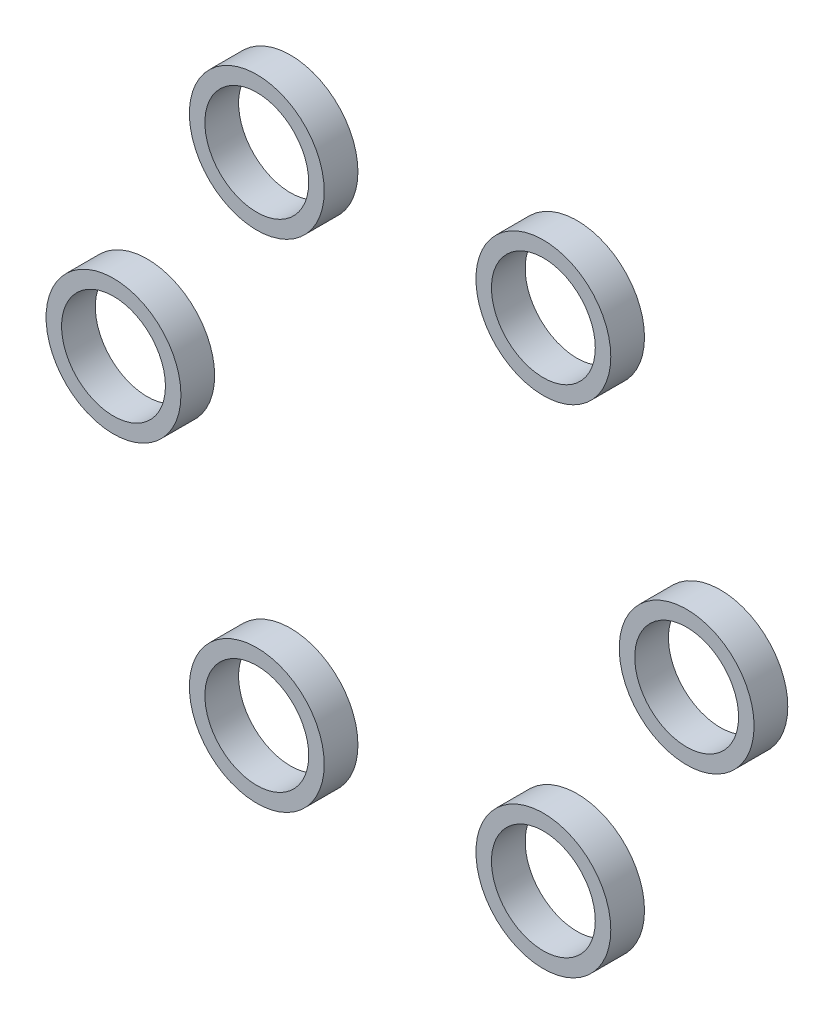
ISO-10303-21;
HEADER;
FILE_DESCRIPTION(('STEP AP214'),'2;1');
FILE_NAME('part.step','',(''),(''),'','','');
FILE_SCHEMA(('AUTOMOTIVE_DESIGN { 1 0 10303 214 1 1 1 1 }'));
ENDSEC;
DATA;
#1=APPLICATION_CONTEXT('core data for automotive mechanical design processes');
#2=APPLICATION_PROTOCOL_DEFINITION('international standard','automotive_design',2000,#1);
#3=PRODUCT_CONTEXT('',#1,'mechanical');
#4=PRODUCT('Part','Part','',(#3));
#5=PRODUCT_RELATED_PRODUCT_CATEGORY('part','',(#4));
#6=PRODUCT_DEFINITION_FORMATION('','',#4);
#7=PRODUCT_DEFINITION_CONTEXT('part definition',#1,'design');
#8=PRODUCT_DEFINITION('design','',#6,#7);
#9=PRODUCT_DEFINITION_SHAPE('','',#8);
#10=(LENGTH_UNIT() NAMED_UNIT(*) SI_UNIT(.MILLI.,.METRE.));
#11=(NAMED_UNIT(*) PLANE_ANGLE_UNIT() SI_UNIT($,.RADIAN.));
#12=(NAMED_UNIT(*) SI_UNIT($,.STERADIAN.) SOLID_ANGLE_UNIT());
#13=UNCERTAINTY_MEASURE_WITH_UNIT(LENGTH_MEASURE(1.E-05),#10,'distance_accuracy_value','');
#14=(GEOMETRIC_REPRESENTATION_CONTEXT(3) GLOBAL_UNCERTAINTY_ASSIGNED_CONTEXT((#13)) GLOBAL_UNIT_ASSIGNED_CONTEXT((#10,
#11,#12)) REPRESENTATION_CONTEXT('',''));
#15=CARTESIAN_POINT('',(0.,0.,0.));
#16=DIRECTION('',(0.,0.,1.));
#17=DIRECTION('',(1.,0.,0.));
#18=AXIS2_PLACEMENT_3D('',#15,#16,#17);
#19=CARTESIAN_POINT('',(-8.5,14.7224318643355,-15.5));
#20=DIRECTION('',(0.,0.,-1.));
#21=DIRECTION('',(-1.,0.,0.));
#22=AXIS2_PLACEMENT_3D('',#19,#20,#21);
#23=CYLINDRICAL_SURFACE('',#22,3.08);
#24=CARTESIAN_POINT('',(-8.5,14.7224318643355,-15.5));
#25=DIRECTION('',(0.,0.,1.));
#26=DIRECTION('',(1.,0.,0.));
#27=AXIS2_PLACEMENT_3D('',#24,#25,#26);
#28=CIRCLE('',#27,3.08);
#29=CARTESIAN_POINT('',(-5.42,14.7224318643355,-15.5));
#30=VERTEX_POINT('',#29);
#31=EDGE_CURVE('P0_E10',#30,#30,#28,.T.);
#32=ORIENTED_EDGE('',*,*,#31,.T.);
#33=EDGE_LOOP('',(#32));
#34=FACE_BOUND('',#33,.T.);
#35=CARTESIAN_POINT('',(-8.5,14.7224318643355,-17.5));
#36=DIRECTION('',(0.,0.,1.));
#37=DIRECTION('',(1.,0.,0.));
#38=AXIS2_PLACEMENT_3D('',#35,#36,#37);
#39=CIRCLE('',#38,3.08);
#40=CARTESIAN_POINT('',(-5.42,14.7224318643355,-17.5));
#41=VERTEX_POINT('',#40);
#42=EDGE_CURVE('P0_E20',#41,#41,#39,.T.);
#43=ORIENTED_EDGE('',*,*,#42,.F.);
#44=EDGE_LOOP('',(#43));
#45=FACE_BOUND('',#44,.T.);
#46=ADVANCED_FACE('P0_F14',(#34,#45),#23,.F.);
#47=CARTESIAN_POINT('',(-8.5,14.7224318643355,-15.5));
#48=DIRECTION('',(0.,0.,-1.));
#49=DIRECTION('',(-1.,0.,0.));
#50=AXIS2_PLACEMENT_3D('',#47,#48,#49);
#51=CYLINDRICAL_SURFACE('',#50,4.);
#52=CARTESIAN_POINT('',(-8.5,14.7224318643355,-15.5));
#53=DIRECTION('',(0.,0.,1.));
#54=DIRECTION('',(1.,0.,0.));
#55=AXIS2_PLACEMENT_3D('',#52,#53,#54);
#56=CIRCLE('',#55,4.);
#57=CARTESIAN_POINT('',(-4.5,14.7224318643355,-15.5));
#58=VERTEX_POINT('',#57);
#59=EDGE_CURVE('P0_E24',#58,#58,#56,.T.);
#60=ORIENTED_EDGE('',*,*,#59,.F.);
#61=EDGE_LOOP('',(#60));
#62=FACE_BOUND('',#61,.T.);
#63=CARTESIAN_POINT('',(-8.5,14.7224318643355,-17.5));
#64=DIRECTION('',(0.,0.,1.));
#65=DIRECTION('',(1.,0.,0.));
#66=AXIS2_PLACEMENT_3D('',#63,#64,#65);
#67=CIRCLE('',#66,4.);
#68=CARTESIAN_POINT('',(-4.5,14.7224318643355,-17.5));
#69=VERTEX_POINT('',#68);
#70=EDGE_CURVE('P0_E28',#69,#69,#67,.T.);
#71=ORIENTED_EDGE('',*,*,#70,.T.);
#72=EDGE_LOOP('',(#71));
#73=FACE_BOUND('',#72,.T.);
#74=ADVANCED_FACE('P0_F34',(#62,#73),#51,.T.);
#75=CARTESIAN_POINT('',(0.,0.,-15.5));
#76=DIRECTION('',(0.,0.,1.));
#77=DIRECTION('',(1.,0.,0.));
#78=AXIS2_PLACEMENT_3D('',#75,#76,#77);
#79=PLANE('',#78);
#80=ORIENTED_EDGE('',*,*,#31,.F.);
#81=EDGE_LOOP('',(#80));
#82=FACE_BOUND('',#81,.T.);
#83=ORIENTED_EDGE('',*,*,#59,.T.);
#84=EDGE_LOOP('',(#83));
#85=FACE_BOUND('',#84,.T.);
#86=ADVANCED_FACE('P0_F38',(#82,#85),#79,.T.);
#87=CARTESIAN_POINT('',(0.,0.,-17.5));
#88=DIRECTION('',(0.,0.,1.));
#89=DIRECTION('',(1.,0.,0.));
#90=AXIS2_PLACEMENT_3D('',#87,#88,#89);
#91=PLANE('',#90);
#92=ORIENTED_EDGE('',*,*,#42,.T.);
#93=EDGE_LOOP('',(#92));
#94=FACE_BOUND('',#93,.T.);
#95=ORIENTED_EDGE('',*,*,#70,.F.);
#96=EDGE_LOOP('',(#95));
#97=FACE_BOUND('',#96,.T.);
#98=ADVANCED_FACE('P0_F36',(#94,#97),#91,.F.);
#99=CLOSED_SHELL('',(#46,#74,#86,#98));
#100=MANIFOLD_SOLID_BREP('P0_B1',#99);
#101=CARTESIAN_POINT('',(-17.,0.,-15.5));
#102=DIRECTION('',(0.,0.,-1.));
#103=DIRECTION('',(-1.,0.,0.));
#104=AXIS2_PLACEMENT_3D('',#101,#102,#103);
#105=CYLINDRICAL_SURFACE('',#104,3.08);
#106=CARTESIAN_POINT('',(-17.,0.,-15.5));
#107=DIRECTION('',(0.,0.,1.));
#108=DIRECTION('',(1.,0.,0.));
#109=AXIS2_PLACEMENT_3D('',#106,#107,#108);
#110=CIRCLE('',#109,3.08);
#111=CARTESIAN_POINT('',(-13.92,0.,-15.5));
#112=VERTEX_POINT('',#111);
#113=EDGE_CURVE('P1_E10',#112,#112,#110,.T.);
#114=ORIENTED_EDGE('',*,*,#113,.T.);
#115=EDGE_LOOP('',(#114));
#116=FACE_BOUND('',#115,.T.);
#117=CARTESIAN_POINT('',(-17.,0.,-17.5));
#118=DIRECTION('',(0.,0.,1.));
#119=DIRECTION('',(1.,0.,0.));
#120=AXIS2_PLACEMENT_3D('',#117,#118,#119);
#121=CIRCLE('',#120,3.08);
#122=CARTESIAN_POINT('',(-13.92,0.,-17.5));
#123=VERTEX_POINT('',#122);
#124=EDGE_CURVE('P1_E20',#123,#123,#121,.T.);
#125=ORIENTED_EDGE('',*,*,#124,.F.);
#126=EDGE_LOOP('',(#125));
#127=FACE_BOUND('',#126,.T.);
#128=ADVANCED_FACE('P1_F14',(#116,#127),#105,.F.);
#129=CARTESIAN_POINT('',(-17.,0.,-15.5));
#130=DIRECTION('',(0.,0.,-1.));
#131=DIRECTION('',(-1.,0.,0.));
#132=AXIS2_PLACEMENT_3D('',#129,#130,#131);
#133=CYLINDRICAL_SURFACE('',#132,4.);
#134=CARTESIAN_POINT('',(-17.,0.,-15.5));
#135=DIRECTION('',(0.,0.,1.));
#136=DIRECTION('',(1.,0.,0.));
#137=AXIS2_PLACEMENT_3D('',#134,#135,#136);
#138=CIRCLE('',#137,4.);
#139=CARTESIAN_POINT('',(-13.,0.,-15.5));
#140=VERTEX_POINT('',#139);
#141=EDGE_CURVE('P1_E24',#140,#140,#138,.T.);
#142=ORIENTED_EDGE('',*,*,#141,.F.);
#143=EDGE_LOOP('',(#142));
#144=FACE_BOUND('',#143,.T.);
#145=CARTESIAN_POINT('',(-17.,0.,-17.5));
#146=DIRECTION('',(0.,0.,1.));
#147=DIRECTION('',(1.,0.,0.));
#148=AXIS2_PLACEMENT_3D('',#145,#146,#147);
#149=CIRCLE('',#148,4.);
#150=CARTESIAN_POINT('',(-13.,0.,-17.5));
#151=VERTEX_POINT('',#150);
#152=EDGE_CURVE('P1_E28',#151,#151,#149,.T.);
#153=ORIENTED_EDGE('',*,*,#152,.T.);
#154=EDGE_LOOP('',(#153));
#155=FACE_BOUND('',#154,.T.);
#156=ADVANCED_FACE('P1_F34',(#144,#155),#133,.T.);
#157=CARTESIAN_POINT('',(0.,0.,-15.5));
#158=DIRECTION('',(0.,0.,1.));
#159=DIRECTION('',(1.,0.,0.));
#160=AXIS2_PLACEMENT_3D('',#157,#158,#159);
#161=PLANE('',#160);
#162=ORIENTED_EDGE('',*,*,#113,.F.);
#163=EDGE_LOOP('',(#162));
#164=FACE_BOUND('',#163,.T.);
#165=ORIENTED_EDGE('',*,*,#141,.T.);
#166=EDGE_LOOP('',(#165));
#167=FACE_BOUND('',#166,.T.);
#168=ADVANCED_FACE('P1_F38',(#164,#167),#161,.T.);
#169=CARTESIAN_POINT('',(0.,0.,-17.5));
#170=DIRECTION('',(0.,0.,1.));
#171=DIRECTION('',(1.,0.,0.));
#172=AXIS2_PLACEMENT_3D('',#169,#170,#171);
#173=PLANE('',#172);
#174=ORIENTED_EDGE('',*,*,#124,.T.);
#175=EDGE_LOOP('',(#174));
#176=FACE_BOUND('',#175,.T.);
#177=ORIENTED_EDGE('',*,*,#152,.F.);
#178=EDGE_LOOP('',(#177));
#179=FACE_BOUND('',#178,.T.);
#180=ADVANCED_FACE('P1_F36',(#176,#179),#173,.F.);
#181=CLOSED_SHELL('',(#128,#156,#168,#180));
#182=MANIFOLD_SOLID_BREP('P1_B1',#181);
#183=CARTESIAN_POINT('',(17.,0.,-15.5));
#184=DIRECTION('',(0.,0.,-1.));
#185=DIRECTION('',(-1.,0.,0.));
#186=AXIS2_PLACEMENT_3D('',#183,#184,#185);
#187=CYLINDRICAL_SURFACE('',#186,3.08);
#188=CARTESIAN_POINT('',(17.,0.,-15.5));
#189=DIRECTION('',(0.,0.,1.));
#190=DIRECTION('',(1.,0.,0.));
#191=AXIS2_PLACEMENT_3D('',#188,#189,#190);
#192=CIRCLE('',#191,3.08);
#193=CARTESIAN_POINT('',(20.08,0.,-15.5));
#194=VERTEX_POINT('',#193);
#195=EDGE_CURVE('P2_E10',#194,#194,#192,.T.);
#196=ORIENTED_EDGE('',*,*,#195,.T.);
#197=EDGE_LOOP('',(#196));
#198=FACE_BOUND('',#197,.T.);
#199=CARTESIAN_POINT('',(17.,0.,-17.5));
#200=DIRECTION('',(0.,0.,1.));
#201=DIRECTION('',(1.,0.,0.));
#202=AXIS2_PLACEMENT_3D('',#199,#200,#201);
#203=CIRCLE('',#202,3.08);
#204=CARTESIAN_POINT('',(20.08,0.,-17.5));
#205=VERTEX_POINT('',#204);
#206=EDGE_CURVE('P2_E20',#205,#205,#203,.T.);
#207=ORIENTED_EDGE('',*,*,#206,.F.);
#208=EDGE_LOOP('',(#207));
#209=FACE_BOUND('',#208,.T.);
#210=ADVANCED_FACE('P2_F14',(#198,#209),#187,.F.);
#211=CARTESIAN_POINT('',(17.,0.,-15.5));
#212=DIRECTION('',(0.,0.,-1.));
#213=DIRECTION('',(-1.,0.,0.));
#214=AXIS2_PLACEMENT_3D('',#211,#212,#213);
#215=CYLINDRICAL_SURFACE('',#214,4.);
#216=CARTESIAN_POINT('',(17.,0.,-15.5));
#217=DIRECTION('',(0.,0.,1.));
#218=DIRECTION('',(1.,0.,0.));
#219=AXIS2_PLACEMENT_3D('',#216,#217,#218);
#220=CIRCLE('',#219,4.);
#221=CARTESIAN_POINT('',(21.,0.,-15.5));
#222=VERTEX_POINT('',#221);
#223=EDGE_CURVE('P2_E24',#222,#222,#220,.T.);
#224=ORIENTED_EDGE('',*,*,#223,.F.);
#225=EDGE_LOOP('',(#224));
#226=FACE_BOUND('',#225,.T.);
#227=CARTESIAN_POINT('',(17.,0.,-17.5));
#228=DIRECTION('',(0.,0.,1.));
#229=DIRECTION('',(1.,0.,0.));
#230=AXIS2_PLACEMENT_3D('',#227,#228,#229);
#231=CIRCLE('',#230,4.);
#232=CARTESIAN_POINT('',(21.,0.,-17.5));
#233=VERTEX_POINT('',#232);
#234=EDGE_CURVE('P2_E28',#233,#233,#231,.T.);
#235=ORIENTED_EDGE('',*,*,#234,.T.);
#236=EDGE_LOOP('',(#235));
#237=FACE_BOUND('',#236,.T.);
#238=ADVANCED_FACE('P2_F34',(#226,#237),#215,.T.);
#239=CARTESIAN_POINT('',(0.,0.,-15.5));
#240=DIRECTION('',(0.,0.,1.));
#241=DIRECTION('',(1.,0.,0.));
#242=AXIS2_PLACEMENT_3D('',#239,#240,#241);
#243=PLANE('',#242);
#244=ORIENTED_EDGE('',*,*,#195,.F.);
#245=EDGE_LOOP('',(#244));
#246=FACE_BOUND('',#245,.T.);
#247=ORIENTED_EDGE('',*,*,#223,.T.);
#248=EDGE_LOOP('',(#247));
#249=FACE_BOUND('',#248,.T.);
#250=ADVANCED_FACE('P2_F38',(#246,#249),#243,.T.);
#251=CARTESIAN_POINT('',(0.,0.,-17.5));
#252=DIRECTION('',(0.,0.,1.));
#253=DIRECTION('',(1.,0.,0.));
#254=AXIS2_PLACEMENT_3D('',#251,#252,#253);
#255=PLANE('',#254);
#256=ORIENTED_EDGE('',*,*,#206,.T.);
#257=EDGE_LOOP('',(#256));
#258=FACE_BOUND('',#257,.T.);
#259=ORIENTED_EDGE('',*,*,#234,.F.);
#260=EDGE_LOOP('',(#259));
#261=FACE_BOUND('',#260,.T.);
#262=ADVANCED_FACE('P2_F36',(#258,#261),#255,.F.);
#263=CLOSED_SHELL('',(#210,#238,#250,#262));
#264=MANIFOLD_SOLID_BREP('P2_B1',#263);
#265=CARTESIAN_POINT('',(-8.5,-14.7224318643355,-15.5));
#266=DIRECTION('',(0.,0.,-1.));
#267=DIRECTION('',(-1.,0.,0.));
#268=AXIS2_PLACEMENT_3D('',#265,#266,#267);
#269=CYLINDRICAL_SURFACE('',#268,3.08);
#270=CARTESIAN_POINT('',(-8.5,-14.7224318643355,-15.5));
#271=DIRECTION('',(0.,0.,1.));
#272=DIRECTION('',(1.,0.,0.));
#273=AXIS2_PLACEMENT_3D('',#270,#271,#272);
#274=CIRCLE('',#273,3.08);
#275=CARTESIAN_POINT('',(-5.42,-14.7224318643355,-15.5));
#276=VERTEX_POINT('',#275);
#277=EDGE_CURVE('P3_E10',#276,#276,#274,.T.);
#278=ORIENTED_EDGE('',*,*,#277,.T.);
#279=EDGE_LOOP('',(#278));
#280=FACE_BOUND('',#279,.T.);
#281=CARTESIAN_POINT('',(-8.5,-14.7224318643355,-17.5));
#282=DIRECTION('',(0.,0.,1.));
#283=DIRECTION('',(1.,0.,0.));
#284=AXIS2_PLACEMENT_3D('',#281,#282,#283);
#285=CIRCLE('',#284,3.08);
#286=CARTESIAN_POINT('',(-5.42,-14.7224318643355,-17.5));
#287=VERTEX_POINT('',#286);
#288=EDGE_CURVE('P3_E20',#287,#287,#285,.T.);
#289=ORIENTED_EDGE('',*,*,#288,.F.);
#290=EDGE_LOOP('',(#289));
#291=FACE_BOUND('',#290,.T.);
#292=ADVANCED_FACE('P3_F14',(#280,#291),#269,.F.);
#293=CARTESIAN_POINT('',(-8.5,-14.7224318643355,-15.5));
#294=DIRECTION('',(0.,0.,-1.));
#295=DIRECTION('',(-1.,0.,0.));
#296=AXIS2_PLACEMENT_3D('',#293,#294,#295);
#297=CYLINDRICAL_SURFACE('',#296,4.);
#298=CARTESIAN_POINT('',(-8.5,-14.7224318643355,-15.5));
#299=DIRECTION('',(0.,0.,1.));
#300=DIRECTION('',(1.,0.,0.));
#301=AXIS2_PLACEMENT_3D('',#298,#299,#300);
#302=CIRCLE('',#301,4.);
#303=CARTESIAN_POINT('',(-4.5,-14.7224318643355,-15.5));
#304=VERTEX_POINT('',#303);
#305=EDGE_CURVE('P3_E24',#304,#304,#302,.T.);
#306=ORIENTED_EDGE('',*,*,#305,.F.);
#307=EDGE_LOOP('',(#306));
#308=FACE_BOUND('',#307,.T.);
#309=CARTESIAN_POINT('',(-8.5,-14.7224318643355,-17.5));
#310=DIRECTION('',(0.,0.,1.));
#311=DIRECTION('',(1.,0.,0.));
#312=AXIS2_PLACEMENT_3D('',#309,#310,#311);
#313=CIRCLE('',#312,4.);
#314=CARTESIAN_POINT('',(-4.5,-14.7224318643355,-17.5));
#315=VERTEX_POINT('',#314);
#316=EDGE_CURVE('P3_E28',#315,#315,#313,.T.);
#317=ORIENTED_EDGE('',*,*,#316,.T.);
#318=EDGE_LOOP('',(#317));
#319=FACE_BOUND('',#318,.T.);
#320=ADVANCED_FACE('P3_F34',(#308,#319),#297,.T.);
#321=CARTESIAN_POINT('',(0.,0.,-15.5));
#322=DIRECTION('',(0.,0.,1.));
#323=DIRECTION('',(1.,0.,0.));
#324=AXIS2_PLACEMENT_3D('',#321,#322,#323);
#325=PLANE('',#324);
#326=ORIENTED_EDGE('',*,*,#277,.F.);
#327=EDGE_LOOP('',(#326));
#328=FACE_BOUND('',#327,.T.);
#329=ORIENTED_EDGE('',*,*,#305,.T.);
#330=EDGE_LOOP('',(#329));
#331=FACE_BOUND('',#330,.T.);
#332=ADVANCED_FACE('P3_F38',(#328,#331),#325,.T.);
#333=CARTESIAN_POINT('',(0.,0.,-17.5));
#334=DIRECTION('',(0.,0.,1.));
#335=DIRECTION('',(1.,0.,0.));
#336=AXIS2_PLACEMENT_3D('',#333,#334,#335);
#337=PLANE('',#336);
#338=ORIENTED_EDGE('',*,*,#288,.T.);
#339=EDGE_LOOP('',(#338));
#340=FACE_BOUND('',#339,.T.);
#341=ORIENTED_EDGE('',*,*,#316,.F.);
#342=EDGE_LOOP('',(#341));
#343=FACE_BOUND('',#342,.T.);
#344=ADVANCED_FACE('P3_F36',(#340,#343),#337,.F.);
#345=CLOSED_SHELL('',(#292,#320,#332,#344));
#346=MANIFOLD_SOLID_BREP('P3_B1',#345);
#347=CARTESIAN_POINT('',(8.5,14.7224318643355,-15.5));
#348=DIRECTION('',(0.,0.,-1.));
#349=DIRECTION('',(-1.,0.,0.));
#350=AXIS2_PLACEMENT_3D('',#347,#348,#349);
#351=CYLINDRICAL_SURFACE('',#350,3.08);
#352=CARTESIAN_POINT('',(8.5,14.7224318643355,-15.5));
#353=DIRECTION('',(0.,0.,1.));
#354=DIRECTION('',(1.,0.,0.));
#355=AXIS2_PLACEMENT_3D('',#352,#353,#354);
#356=CIRCLE('',#355,3.08);
#357=CARTESIAN_POINT('',(11.58,14.7224318643355,-15.5));
#358=VERTEX_POINT('',#357);
#359=EDGE_CURVE('P4_E10',#358,#358,#356,.T.);
#360=ORIENTED_EDGE('',*,*,#359,.T.);
#361=EDGE_LOOP('',(#360));
#362=FACE_BOUND('',#361,.T.);
#363=CARTESIAN_POINT('',(8.5,14.7224318643355,-17.5));
#364=DIRECTION('',(0.,0.,1.));
#365=DIRECTION('',(1.,0.,0.));
#366=AXIS2_PLACEMENT_3D('',#363,#364,#365);
#367=CIRCLE('',#366,3.08);
#368=CARTESIAN_POINT('',(11.58,14.7224318643355,-17.5));
#369=VERTEX_POINT('',#368);
#370=EDGE_CURVE('P4_E20',#369,#369,#367,.T.);
#371=ORIENTED_EDGE('',*,*,#370,.F.);
#372=EDGE_LOOP('',(#371));
#373=FACE_BOUND('',#372,.T.);
#374=ADVANCED_FACE('P4_F14',(#362,#373),#351,.F.);
#375=CARTESIAN_POINT('',(8.5,14.7224318643355,-15.5));
#376=DIRECTION('',(0.,0.,-1.));
#377=DIRECTION('',(-1.,0.,0.));
#378=AXIS2_PLACEMENT_3D('',#375,#376,#377);
#379=CYLINDRICAL_SURFACE('',#378,4.);
#380=CARTESIAN_POINT('',(8.5,14.7224318643355,-15.5));
#381=DIRECTION('',(0.,0.,1.));
#382=DIRECTION('',(1.,0.,0.));
#383=AXIS2_PLACEMENT_3D('',#380,#381,#382);
#384=CIRCLE('',#383,4.);
#385=CARTESIAN_POINT('',(12.5,14.7224318643355,-15.5));
#386=VERTEX_POINT('',#385);
#387=EDGE_CURVE('P4_E24',#386,#386,#384,.T.);
#388=ORIENTED_EDGE('',*,*,#387,.F.);
#389=EDGE_LOOP('',(#388));
#390=FACE_BOUND('',#389,.T.);
#391=CARTESIAN_POINT('',(8.5,14.7224318643355,-17.5));
#392=DIRECTION('',(0.,0.,1.));
#393=DIRECTION('',(1.,0.,0.));
#394=AXIS2_PLACEMENT_3D('',#391,#392,#393);
#395=CIRCLE('',#394,4.);
#396=CARTESIAN_POINT('',(12.5,14.7224318643355,-17.5));
#397=VERTEX_POINT('',#396);
#398=EDGE_CURVE('P4_E28',#397,#397,#395,.T.);
#399=ORIENTED_EDGE('',*,*,#398,.T.);
#400=EDGE_LOOP('',(#399));
#401=FACE_BOUND('',#400,.T.);
#402=ADVANCED_FACE('P4_F34',(#390,#401),#379,.T.);
#403=CARTESIAN_POINT('',(0.,0.,-15.5));
#404=DIRECTION('',(0.,0.,1.));
#405=DIRECTION('',(1.,0.,0.));
#406=AXIS2_PLACEMENT_3D('',#403,#404,#405);
#407=PLANE('',#406);
#408=ORIENTED_EDGE('',*,*,#359,.F.);
#409=EDGE_LOOP('',(#408));
#410=FACE_BOUND('',#409,.T.);
#411=ORIENTED_EDGE('',*,*,#387,.T.);
#412=EDGE_LOOP('',(#411));
#413=FACE_BOUND('',#412,.T.);
#414=ADVANCED_FACE('P4_F38',(#410,#413),#407,.T.);
#415=CARTESIAN_POINT('',(0.,0.,-17.5));
#416=DIRECTION('',(0.,0.,1.));
#417=DIRECTION('',(1.,0.,0.));
#418=AXIS2_PLACEMENT_3D('',#415,#416,#417);
#419=PLANE('',#418);
#420=ORIENTED_EDGE('',*,*,#370,.T.);
#421=EDGE_LOOP('',(#420));
#422=FACE_BOUND('',#421,.T.);
#423=ORIENTED_EDGE('',*,*,#398,.F.);
#424=EDGE_LOOP('',(#423));
#425=FACE_BOUND('',#424,.T.);
#426=ADVANCED_FACE('P4_F36',(#422,#425),#419,.F.);
#427=CLOSED_SHELL('',(#374,#402,#414,#426));
#428=MANIFOLD_SOLID_BREP('P4_B1',#427);
#429=CARTESIAN_POINT('',(8.5,-14.7224318643355,-15.5));
#430=DIRECTION('',(0.,0.,-1.));
#431=DIRECTION('',(-1.,0.,0.));
#432=AXIS2_PLACEMENT_3D('',#429,#430,#431);
#433=CYLINDRICAL_SURFACE('',#432,3.08);
#434=CARTESIAN_POINT('',(8.5,-14.7224318643355,-15.5));
#435=DIRECTION('',(0.,0.,1.));
#436=DIRECTION('',(1.,0.,0.));
#437=AXIS2_PLACEMENT_3D('',#434,#435,#436);
#438=CIRCLE('',#437,3.08);
#439=CARTESIAN_POINT('',(11.58,-14.7224318643355,-15.5));
#440=VERTEX_POINT('',#439);
#441=EDGE_CURVE('P5_E9',#440,#440,#438,.T.);
#442=ORIENTED_EDGE('',*,*,#441,.T.);
#443=EDGE_LOOP('',(#442));
#444=FACE_BOUND('',#443,.T.);
#445=CARTESIAN_POINT('',(8.5,-14.7224318643355,-17.5));
#446=DIRECTION('',(0.,0.,1.));
#447=DIRECTION('',(1.,0.,0.));
#448=AXIS2_PLACEMENT_3D('',#445,#446,#447);
#449=CIRCLE('',#448,3.08);
#450=CARTESIAN_POINT('',(11.58,-14.7224318643355,-17.5));
#451=VERTEX_POINT('',#450);
#452=EDGE_CURVE('P5_E20',#451,#451,#449,.T.);
#453=ORIENTED_EDGE('',*,*,#452,.F.);
#454=EDGE_LOOP('',(#453));
#455=FACE_BOUND('',#454,.T.);
#456=ADVANCED_FACE('P5_F13',(#444,#455),#433,.F.);
#457=CARTESIAN_POINT('',(8.5,-14.7224318643355,-15.5));
#458=DIRECTION('',(0.,0.,-1.));
#459=DIRECTION('',(-1.,0.,0.));
#460=AXIS2_PLACEMENT_3D('',#457,#458,#459);
#461=CYLINDRICAL_SURFACE('',#460,4.);
#462=CARTESIAN_POINT('',(8.5,-14.7224318643355,-15.5));
#463=DIRECTION('',(0.,0.,1.));
#464=DIRECTION('',(1.,0.,0.));
#465=AXIS2_PLACEMENT_3D('',#462,#463,#464);
#466=CIRCLE('',#465,4.);
#467=CARTESIAN_POINT('',(12.5,-14.7224318643355,-15.5));
#468=VERTEX_POINT('',#467);
#469=EDGE_CURVE('P5_E26',#468,#468,#466,.T.);
#470=ORIENTED_EDGE('',*,*,#469,.F.);
#471=EDGE_LOOP('',(#470));
#472=FACE_BOUND('',#471,.T.);
#473=CARTESIAN_POINT('',(8.5,-14.7224318643355,-17.5));
#474=DIRECTION('',(0.,0.,1.));
#475=DIRECTION('',(1.,0.,0.));
#476=AXIS2_PLACEMENT_3D('',#473,#474,#475);
#477=CIRCLE('',#476,4.);
#478=CARTESIAN_POINT('',(12.5,-14.7224318643355,-17.5));
#479=VERTEX_POINT('',#478);
#480=EDGE_CURVE('P5_E31',#479,#479,#477,.T.);
#481=ORIENTED_EDGE('',*,*,#480,.T.);
#482=EDGE_LOOP('',(#481));
#483=FACE_BOUND('',#482,.T.);
#484=ADVANCED_FACE('P5_F38',(#472,#483),#461,.T.);
#485=CARTESIAN_POINT('',(0.,0.,-15.5));
#486=DIRECTION('',(0.,0.,1.));
#487=DIRECTION('',(1.,0.,0.));
#488=AXIS2_PLACEMENT_3D('',#485,#486,#487);
#489=PLANE('',#488);
#490=ORIENTED_EDGE('',*,*,#441,.F.);
#491=EDGE_LOOP('',(#490));
#492=FACE_BOUND('',#491,.T.);
#493=ORIENTED_EDGE('',*,*,#469,.T.);
#494=EDGE_LOOP('',(#493));
#495=FACE_BOUND('',#494,.T.);
#496=ADVANCED_FACE('P5_F42',(#492,#495),#489,.T.);
#497=CARTESIAN_POINT('',(0.,0.,-17.5));
#498=DIRECTION('',(0.,0.,1.));
#499=DIRECTION('',(1.,0.,0.));
#500=AXIS2_PLACEMENT_3D('',#497,#498,#499);
#501=PLANE('',#500);
#502=ORIENTED_EDGE('',*,*,#452,.T.);
#503=EDGE_LOOP('',(#502));
#504=FACE_BOUND('',#503,.T.);
#505=ORIENTED_EDGE('',*,*,#480,.F.);
#506=EDGE_LOOP('',(#505));
#507=FACE_BOUND('',#506,.T.);
#508=ADVANCED_FACE('P5_F40',(#504,#507),#501,.F.);
#509=CLOSED_SHELL('',(#456,#484,#496,#508));
#510=MANIFOLD_SOLID_BREP('P5_B1',#509);
#511=ADVANCED_BREP_SHAPE_REPRESENTATION('',(#18,#100,#182,#264,#346,#428,#510),#14);
#512=SHAPE_DEFINITION_REPRESENTATION(#9,#511);
ENDSEC;
END-ISO-10303-21;
